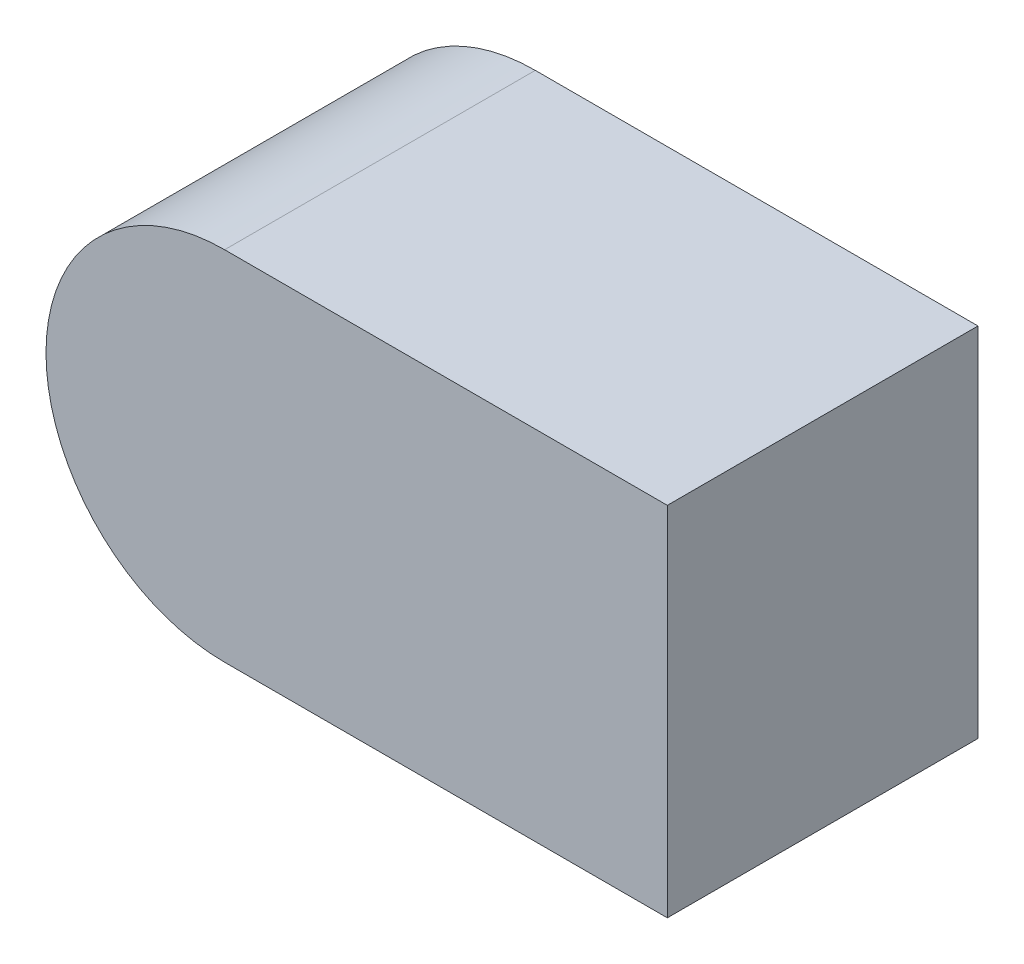
ISO-10303-21;
HEADER;
FILE_DESCRIPTION(('STEP AP214'),'2;1');
FILE_NAME('part.step','',(''),(''),'','','');
FILE_SCHEMA(('AUTOMOTIVE_DESIGN { 1 0 10303 214 1 1 1 1 }'));
ENDSEC;
DATA;
#1=APPLICATION_CONTEXT('core data for automotive mechanical design processes');
#2=APPLICATION_PROTOCOL_DEFINITION('international standard','automotive_design',2000,#1);
#3=PRODUCT_CONTEXT('',#1,'mechanical');
#4=PRODUCT('Part','Part','',(#3));
#5=PRODUCT_RELATED_PRODUCT_CATEGORY('part','',(#4));
#6=PRODUCT_DEFINITION_FORMATION('','',#4);
#7=PRODUCT_DEFINITION_CONTEXT('part definition',#1,'design');
#8=PRODUCT_DEFINITION('design','',#6,#7);
#9=PRODUCT_DEFINITION_SHAPE('','',#8);
#10=(LENGTH_UNIT() NAMED_UNIT(*) SI_UNIT(.MILLI.,.METRE.));
#11=(NAMED_UNIT(*) PLANE_ANGLE_UNIT() SI_UNIT($,.RADIAN.));
#12=(NAMED_UNIT(*) SI_UNIT($,.STERADIAN.) SOLID_ANGLE_UNIT());
#13=UNCERTAINTY_MEASURE_WITH_UNIT(LENGTH_MEASURE(1.E-05),#10,'distance_accuracy_value','');
#14=(GEOMETRIC_REPRESENTATION_CONTEXT(3) GLOBAL_UNCERTAINTY_ASSIGNED_CONTEXT((#13)) GLOBAL_UNIT_ASSIGNED_CONTEXT((#10,
#11,#12)) REPRESENTATION_CONTEXT('',''));
#15=CARTESIAN_POINT('',(0.,0.,0.));
#16=DIRECTION('',(0.,0.,1.));
#17=DIRECTION('',(1.,0.,0.));
#18=AXIS2_PLACEMENT_3D('',#15,#16,#17);
#19=CARTESIAN_POINT('',(2.8335240809167,2.25,0.2));
#20=DIRECTION('',(0.,0.,1.));
#21=DIRECTION('',(1.,0.,0.));
#22=AXIS2_PLACEMENT_3D('',#19,#20,#21);
#23=PLANE('',#22);
#24=DIRECTION('',(1.,0.,0.));
#25=VECTOR('',#24,1.);
#26=CARTESIAN_POINT('',(2.715,2.135,0.2));
#27=LINE('',#26,#25);
#28=CARTESIAN_POINT('',(2.715,2.135,0.2));
#29=VERTEX_POINT('',#28);
#30=CARTESIAN_POINT('',(3.,2.135,0.2));
#31=VERTEX_POINT('',#30);
#32=EDGE_CURVE('E11',#29,#31,#27,.T.);
#33=ORIENTED_EDGE('',*,*,#32,.T.);
#34=DIRECTION('',(0.,1.,0.));
#35=VECTOR('',#34,1.);
#36=CARTESIAN_POINT('',(3.,-0.375,0.2));
#37=LINE('',#36,#35);
#38=CARTESIAN_POINT('',(3.,2.365,0.2));
#39=VERTEX_POINT('',#38);
#40=EDGE_CURVE('E24',#31,#39,#37,.T.);
#41=ORIENTED_EDGE('',*,*,#40,.T.);
#42=DIRECTION('',(-1.,0.,0.));
#43=VECTOR('',#42,1.);
#44=CARTESIAN_POINT('',(3.,2.365,0.2));
#45=LINE('',#44,#43);
#46=CARTESIAN_POINT('',(2.715,2.365,0.2));
#47=VERTEX_POINT('',#46);
#48=EDGE_CURVE('E88',#39,#47,#45,.T.);
#49=ORIENTED_EDGE('',*,*,#48,.T.);
#50=CARTESIAN_POINT('',(2.715,2.25,0.2));
#51=DIRECTION('',(0.,0.,1.));
#52=DIRECTION('',(0.,1.,0.));
#53=AXIS2_PLACEMENT_3D('',#50,#51,#52);
#54=CIRCLE('',#53,0.115);
#55=EDGE_CURVE('E70',#47,#29,#54,.T.);
#56=ORIENTED_EDGE('',*,*,#55,.T.);
#57=EDGE_LOOP('',(#33,#41,#49,#56));
#58=FACE_BOUND('',#57,.T.);
#59=ADVANCED_FACE('F17',(#58),#23,.T.);
#60=CARTESIAN_POINT('',(3.,-3.,0.));
#61=DIRECTION('',(1.,0.,0.));
#62=DIRECTION('',(0.,1.,0.));
#63=AXIS2_PLACEMENT_3D('',#60,#61,#62);
#64=PLANE('',#63);
#65=DIRECTION('',(0.,0.,-1.));
#66=VECTOR('',#65,1.);
#67=CARTESIAN_POINT('',(3.,2.365,0.));
#68=LINE('',#67,#66);
#69=CARTESIAN_POINT('',(3.,2.365,0.));
#70=VERTEX_POINT('',#69);
#71=EDGE_CURVE('E76',#39,#70,#68,.T.);
#72=ORIENTED_EDGE('',*,*,#71,.F.);
#73=ORIENTED_EDGE('',*,*,#40,.F.);
#74=DIRECTION('',(0.,0.,1.));
#75=VECTOR('',#74,1.);
#76=CARTESIAN_POINT('',(3.,2.135,0.));
#77=LINE('',#76,#75);
#78=CARTESIAN_POINT('',(3.,2.135,0.));
#79=VERTEX_POINT('',#78);
#80=EDGE_CURVE('E84',#79,#31,#77,.T.);
#81=ORIENTED_EDGE('',*,*,#80,.F.);
#82=DIRECTION('',(0.,1.,0.));
#83=VECTOR('',#82,1.);
#84=CARTESIAN_POINT('',(3.,2.135,0.));
#85=LINE('',#84,#83);
#86=EDGE_CURVE('E82',#79,#70,#85,.T.);
#87=ORIENTED_EDGE('',*,*,#86,.T.);
#88=EDGE_LOOP('',(#72,#73,#81,#87));
#89=FACE_BOUND('',#88,.T.);
#90=ADVANCED_FACE('F90',(#89),#64,.T.);
#91=CARTESIAN_POINT('',(2.715,2.135,0.));
#92=DIRECTION('',(0.,-1.,0.));
#93=DIRECTION('',(1.,0.,0.));
#94=AXIS2_PLACEMENT_3D('',#91,#92,#93);
#95=PLANE('',#94);
#96=DIRECTION('',(1.,0.,0.));
#97=VECTOR('',#96,1.);
#98=CARTESIAN_POINT('',(2.715,2.135,0.));
#99=LINE('',#98,#97);
#100=CARTESIAN_POINT('',(2.715,2.135,0.));
#101=VERTEX_POINT('',#100);
#102=EDGE_CURVE('E61',#101,#79,#99,.T.);
#103=ORIENTED_EDGE('',*,*,#102,.T.);
#104=ORIENTED_EDGE('',*,*,#80,.T.);
#105=ORIENTED_EDGE('',*,*,#32,.F.);
#106=DIRECTION('',(0.,0.,1.));
#107=VECTOR('',#106,1.);
#108=CARTESIAN_POINT('',(2.715,2.135,0.));
#109=LINE('',#108,#107);
#110=EDGE_CURVE('E64',#101,#29,#109,.T.);
#111=ORIENTED_EDGE('',*,*,#110,.F.);
#112=EDGE_LOOP('',(#103,#104,#105,#111));
#113=FACE_BOUND('',#112,.T.);
#114=ADVANCED_FACE('F91',(#113),#95,.T.);
#115=CARTESIAN_POINT('',(2.715,2.25,0.));
#116=DIRECTION('',(0.,0.,1.));
#117=DIRECTION('',(0.,1.,0.));
#118=AXIS2_PLACEMENT_3D('',#115,#116,#117);
#119=CYLINDRICAL_SURFACE('',#118,0.115);
#120=CARTESIAN_POINT('',(2.715,2.25,0.));
#121=DIRECTION('',(0.,0.,1.));
#122=DIRECTION('',(0.,1.,0.));
#123=AXIS2_PLACEMENT_3D('',#120,#121,#122);
#124=CIRCLE('',#123,0.115);
#125=CARTESIAN_POINT('',(2.715,2.365,0.));
#126=VERTEX_POINT('',#125);
#127=EDGE_CURVE('E54',#126,#101,#124,.T.);
#128=ORIENTED_EDGE('',*,*,#127,.T.);
#129=ORIENTED_EDGE('',*,*,#110,.T.);
#130=ORIENTED_EDGE('',*,*,#55,.F.);
#131=DIRECTION('',(0.,0.,1.));
#132=VECTOR('',#131,1.);
#133=CARTESIAN_POINT('',(2.715,2.365,0.));
#134=LINE('',#133,#132);
#135=EDGE_CURVE('E65',#126,#47,#134,.T.);
#136=ORIENTED_EDGE('',*,*,#135,.F.);
#137=EDGE_LOOP('',(#128,#129,#130,#136));
#138=FACE_BOUND('',#137,.T.);
#139=ADVANCED_FACE('F69',(#138),#119,.T.);
#140=CARTESIAN_POINT('',(3.,2.365,0.));
#141=DIRECTION('',(0.,1.,0.));
#142=DIRECTION('',(-1.,0.,0.));
#143=AXIS2_PLACEMENT_3D('',#140,#141,#142);
#144=PLANE('',#143);
#145=DIRECTION('',(-1.,0.,0.));
#146=VECTOR('',#145,1.);
#147=CARTESIAN_POINT('',(3.,2.365,0.));
#148=LINE('',#147,#146);
#149=EDGE_CURVE('E59',#70,#126,#148,.T.);
#150=ORIENTED_EDGE('',*,*,#149,.T.);
#151=ORIENTED_EDGE('',*,*,#135,.T.);
#152=ORIENTED_EDGE('',*,*,#48,.F.);
#153=ORIENTED_EDGE('',*,*,#71,.T.);
#154=EDGE_LOOP('',(#150,#151,#152,#153));
#155=FACE_BOUND('',#154,.T.);
#156=ADVANCED_FACE('F74',(#155),#144,.T.);
#157=CARTESIAN_POINT('',(2.8335265642716,2.25,0.));
#158=DIRECTION('',(0.,0.,1.));
#159=DIRECTION('',(-1.,0.,0.));
#160=AXIS2_PLACEMENT_3D('',#157,#158,#159);
#161=PLANE('',#160);
#162=ORIENTED_EDGE('',*,*,#86,.F.);
#163=ORIENTED_EDGE('',*,*,#102,.F.);
#164=ORIENTED_EDGE('',*,*,#127,.F.);
#165=ORIENTED_EDGE('',*,*,#149,.F.);
#166=EDGE_LOOP('',(#162,#163,#164,#165));
#167=FACE_BOUND('',#166,.T.);
#168=ADVANCED_FACE('F57',(#167),#161,.F.);
#169=CLOSED_SHELL('',(#59,#90,#114,#139,#156,#168));
#170=MANIFOLD_SOLID_BREP('B1',#169);
#171=ADVANCED_BREP_SHAPE_REPRESENTATION('',(#18,#170),#14);
#172=SHAPE_DEFINITION_REPRESENTATION(#9,#171);
ENDSEC;
END-ISO-10303-21;
